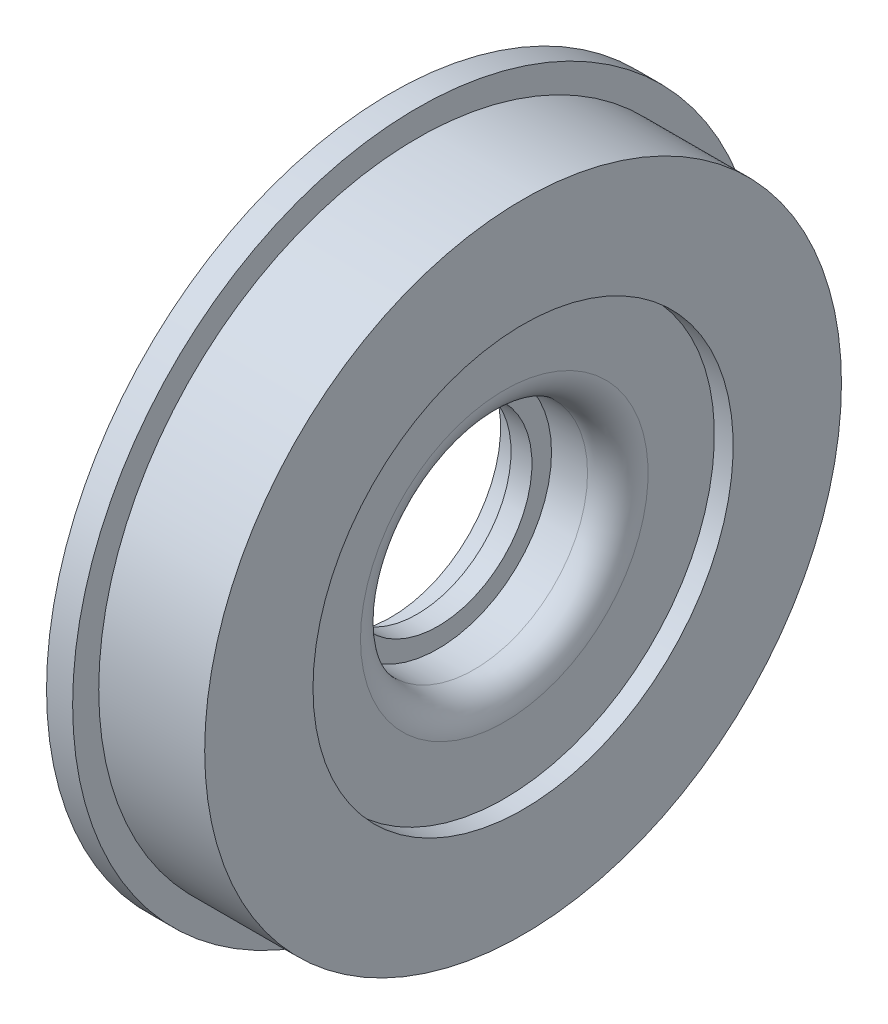
ISO-10303-21;
HEADER;
FILE_DESCRIPTION(('STEP AP214'),'2;1');
FILE_NAME('part.step','',(''),(''),'','','');
FILE_SCHEMA(('AUTOMOTIVE_DESIGN { 1 0 10303 214 1 1 1 1 }'));
ENDSEC;
DATA;
#1=APPLICATION_CONTEXT('core data for automotive mechanical design processes');
#2=APPLICATION_PROTOCOL_DEFINITION('international standard','automotive_design',2000,#1);
#3=PRODUCT_CONTEXT('',#1,'mechanical');
#4=PRODUCT('Part','Part','',(#3));
#5=PRODUCT_RELATED_PRODUCT_CATEGORY('part','',(#4));
#6=PRODUCT_DEFINITION_FORMATION('','',#4);
#7=PRODUCT_DEFINITION_CONTEXT('part definition',#1,'design');
#8=PRODUCT_DEFINITION('design','',#6,#7);
#9=PRODUCT_DEFINITION_SHAPE('','',#8);
#10=(LENGTH_UNIT() NAMED_UNIT(*) SI_UNIT(.MILLI.,.METRE.));
#11=(NAMED_UNIT(*) PLANE_ANGLE_UNIT() SI_UNIT($,.RADIAN.));
#12=(NAMED_UNIT(*) SI_UNIT($,.STERADIAN.) SOLID_ANGLE_UNIT());
#13=UNCERTAINTY_MEASURE_WITH_UNIT(LENGTH_MEASURE(1.E-05),#10,'distance_accuracy_value','');
#14=(GEOMETRIC_REPRESENTATION_CONTEXT(3) GLOBAL_UNCERTAINTY_ASSIGNED_CONTEXT((#13)) GLOBAL_UNIT_ASSIGNED_CONTEXT((#10,
#11,#12)) REPRESENTATION_CONTEXT('',''));
#15=CARTESIAN_POINT('',(0.,0.,0.));
#16=DIRECTION('',(0.,0.,1.));
#17=DIRECTION('',(1.,0.,0.));
#18=AXIS2_PLACEMENT_3D('',#15,#16,#17);
#19=CARTESIAN_POINT('',(0.,66.,0.));
#20=DIRECTION('',(1.,0.,0.));
#21=DIRECTION('',(0.,0.,-1.));
#22=AXIS2_PLACEMENT_3D('',#19,#20,#21);
#23=PLANE('',#22);
#24=CARTESIAN_POINT('',(0.,0.,0.));
#25=DIRECTION('',(-1.,0.,0.));
#26=DIRECTION('',(0.,0.,1.));
#27=AXIS2_PLACEMENT_3D('',#24,#25,#26);
#28=CIRCLE('',#27,21.);
#29=CARTESIAN_POINT('',(0.,0.,21.));
#30=VERTEX_POINT('',#29);
#31=EDGE_CURVE('E10',#30,#30,#28,.T.);
#32=ORIENTED_EDGE('',*,*,#31,.F.);
#33=EDGE_LOOP('',(#32));
#34=FACE_BOUND('',#33,.T.);
#35=CARTESIAN_POINT('',(0.,0.,0.));
#36=DIRECTION('',(-1.,0.,0.));
#37=DIRECTION('',(0.,0.,1.));
#38=AXIS2_PLACEMENT_3D('',#35,#36,#37);
#39=CIRCLE('',#38,66.);
#40=CARTESIAN_POINT('',(0.,0.,66.));
#41=VERTEX_POINT('',#40);
#42=EDGE_CURVE('E94',#41,#41,#39,.T.);
#43=ORIENTED_EDGE('',*,*,#42,.T.);
#44=EDGE_LOOP('',(#43));
#45=FACE_BOUND('',#44,.T.);
#46=ADVANCED_FACE('F37',(#34,#45),#23,.F.);
#47=CARTESIAN_POINT('',(0.,0.,0.));
#48=DIRECTION('',(-1.,0.,0.));
#49=DIRECTION('',(0.,0.,1.));
#50=AXIS2_PLACEMENT_3D('',#47,#48,#49);
#51=CYLINDRICAL_SURFACE('',#50,21.);
#52=CARTESIAN_POINT('',(5.,0.,0.));
#53=DIRECTION('',(-1.,0.,0.));
#54=DIRECTION('',(0.,0.,1.));
#55=AXIS2_PLACEMENT_3D('',#52,#53,#54);
#56=CIRCLE('',#55,21.);
#57=CARTESIAN_POINT('',(5.,0.,21.));
#58=VERTEX_POINT('',#57);
#59=EDGE_CURVE('E44',#58,#58,#56,.T.);
#60=ORIENTED_EDGE('',*,*,#59,.F.);
#61=EDGE_LOOP('',(#60));
#62=FACE_BOUND('',#61,.T.);
#63=ORIENTED_EDGE('',*,*,#31,.T.);
#64=EDGE_LOOP('',(#63));
#65=FACE_BOUND('',#64,.T.);
#66=ADVANCED_FACE('F163',(#62,#65),#51,.F.);
#67=CARTESIAN_POINT('',(5.,21.,0.));
#68=DIRECTION('',(1.,0.,0.));
#69=DIRECTION('',(0.,0.,-1.));
#70=AXIS2_PLACEMENT_3D('',#67,#68,#69);
#71=PLANE('',#70);
#72=CARTESIAN_POINT('',(5.,0.,0.));
#73=DIRECTION('',(-1.,0.,0.));
#74=DIRECTION('',(0.,0.,1.));
#75=AXIS2_PLACEMENT_3D('',#72,#73,#74);
#76=CIRCLE('',#75,18.);
#77=CARTESIAN_POINT('',(5.,0.,18.));
#78=VERTEX_POINT('',#77);
#79=EDGE_CURVE('E50',#78,#78,#76,.T.);
#80=ORIENTED_EDGE('',*,*,#79,.F.);
#81=EDGE_LOOP('',(#80));
#82=FACE_BOUND('',#81,.T.);
#83=ORIENTED_EDGE('',*,*,#59,.T.);
#84=EDGE_LOOP('',(#83));
#85=FACE_BOUND('',#84,.T.);
#86=ADVANCED_FACE('F158',(#82,#85),#71,.F.);
#87=CARTESIAN_POINT('',(0.,0.,0.));
#88=DIRECTION('',(-1.,0.,0.));
#89=DIRECTION('',(0.,0.,1.));
#90=AXIS2_PLACEMENT_3D('',#87,#88,#89);
#91=CYLINDRICAL_SURFACE('',#90,18.);
#92=CARTESIAN_POINT('',(8.99999999999999,0.,0.));
#93=DIRECTION('',(-1.,0.,0.));
#94=DIRECTION('',(0.,0.,1.));
#95=AXIS2_PLACEMENT_3D('',#92,#93,#94);
#96=CIRCLE('',#95,18.);
#97=CARTESIAN_POINT('',(8.99999999999999,0.,18.));
#98=VERTEX_POINT('',#97);
#99=EDGE_CURVE('E56',#98,#98,#96,.T.);
#100=ORIENTED_EDGE('',*,*,#99,.F.);
#101=EDGE_LOOP('',(#100));
#102=FACE_BOUND('',#101,.T.);
#103=ORIENTED_EDGE('',*,*,#79,.T.);
#104=EDGE_LOOP('',(#103));
#105=FACE_BOUND('',#104,.T.);
#106=ADVANCED_FACE('F152',(#102,#105),#91,.F.);
#107=CARTESIAN_POINT('',(8.99999999999999,18.,0.));
#108=DIRECTION('',(-1.,0.,0.));
#109=DIRECTION('',(0.,0.,1.));
#110=AXIS2_PLACEMENT_3D('',#107,#108,#109);
#111=PLANE('',#110);
#112=CARTESIAN_POINT('',(8.99999999999999,0.,0.));
#113=DIRECTION('',(-1.,0.,0.));
#114=DIRECTION('',(0.,0.,1.));
#115=AXIS2_PLACEMENT_3D('',#112,#113,#114);
#116=CIRCLE('',#115,21.75);
#117=CARTESIAN_POINT('',(8.99999999999999,0.,21.75));
#118=VERTEX_POINT('',#117);
#119=EDGE_CURVE('E62',#118,#118,#116,.T.);
#120=ORIENTED_EDGE('',*,*,#119,.F.);
#121=EDGE_LOOP('',(#120));
#122=FACE_BOUND('',#121,.T.);
#123=ORIENTED_EDGE('',*,*,#99,.T.);
#124=EDGE_LOOP('',(#123));
#125=FACE_BOUND('',#124,.T.);
#126=ADVANCED_FACE('F146',(#122,#125),#111,.F.);
#127=CARTESIAN_POINT('',(0.,0.,0.));
#128=DIRECTION('',(-1.,0.,0.));
#129=DIRECTION('',(0.,0.,1.));
#130=AXIS2_PLACEMENT_3D('',#127,#128,#129);
#131=CYLINDRICAL_SURFACE('',#130,21.75);
#132=CARTESIAN_POINT('',(15.9,0.,0.));
#133=DIRECTION('',(-1.,0.,0.));
#134=DIRECTION('',(0.,0.,1.));
#135=AXIS2_PLACEMENT_3D('',#132,#133,#134);
#136=CIRCLE('',#135,21.75);
#137=CARTESIAN_POINT('',(15.9,0.,21.75));
#138=VERTEX_POINT('',#137);
#139=EDGE_CURVE('E66',#138,#138,#136,.T.);
#140=ORIENTED_EDGE('',*,*,#139,.F.);
#141=EDGE_LOOP('',(#140));
#142=FACE_BOUND('',#141,.T.);
#143=ORIENTED_EDGE('',*,*,#119,.T.);
#144=EDGE_LOOP('',(#143));
#145=FACE_BOUND('',#144,.T.);
#146=ADVANCED_FACE('F140',(#142,#145),#131,.F.);
#147=CARTESIAN_POINT('',(15.9,0.,0.));
#148=DIRECTION('',(-1.,0.,0.));
#149=DIRECTION('',(0.,0.,1.));
#150=AXIS2_PLACEMENT_3D('',#147,#148,#149);
#151=TOROIDAL_SURFACE('',#150,27.55,5.8);
#152=CARTESIAN_POINT('',(21.7,0.,0.));
#153=DIRECTION('',(-1.,0.,0.));
#154=DIRECTION('',(0.,0.,1.));
#155=AXIS2_PLACEMENT_3D('',#152,#153,#154);
#156=CIRCLE('',#155,27.55);
#157=CARTESIAN_POINT('',(21.7,0.,27.55));
#158=VERTEX_POINT('',#157);
#159=EDGE_CURVE('E70',#158,#158,#156,.T.);
#160=ORIENTED_EDGE('',*,*,#159,.F.);
#161=EDGE_LOOP('',(#160));
#162=FACE_BOUND('',#161,.T.);
#163=ORIENTED_EDGE('',*,*,#139,.T.);
#164=EDGE_LOOP('',(#163));
#165=FACE_BOUND('',#164,.T.);
#166=ADVANCED_FACE('F134',(#162,#165),#151,.T.);
#167=CARTESIAN_POINT('',(21.7,27.55,0.));
#168=DIRECTION('',(-1.,0.,0.));
#169=DIRECTION('',(0.,0.,1.));
#170=AXIS2_PLACEMENT_3D('',#167,#168,#169);
#171=PLANE('',#170);
#172=CARTESIAN_POINT('',(21.7,0.,0.));
#173=DIRECTION('',(-1.,0.,0.));
#174=DIRECTION('',(0.,0.,1.));
#175=AXIS2_PLACEMENT_3D('',#172,#173,#174);
#176=CIRCLE('',#175,40.25);
#177=CARTESIAN_POINT('',(21.7,0.,40.25));
#178=VERTEX_POINT('',#177);
#179=EDGE_CURVE('E74',#178,#178,#176,.T.);
#180=ORIENTED_EDGE('',*,*,#179,.F.);
#181=EDGE_LOOP('',(#180));
#182=FACE_BOUND('',#181,.T.);
#183=ORIENTED_EDGE('',*,*,#159,.T.);
#184=EDGE_LOOP('',(#183));
#185=FACE_BOUND('',#184,.T.);
#186=ADVANCED_FACE('F128',(#182,#185),#171,.F.);
#187=CARTESIAN_POINT('',(0.,0.,0.));
#188=DIRECTION('',(-1.,0.,0.));
#189=DIRECTION('',(0.,0.,1.));
#190=AXIS2_PLACEMENT_3D('',#187,#188,#189);
#191=CYLINDRICAL_SURFACE('',#190,40.25);
#192=CARTESIAN_POINT('',(25.3,0.,0.));
#193=DIRECTION('',(-1.,0.,0.));
#194=DIRECTION('',(0.,0.,1.));
#195=AXIS2_PLACEMENT_3D('',#192,#193,#194);
#196=CIRCLE('',#195,40.25);
#197=CARTESIAN_POINT('',(25.3,0.,40.25));
#198=VERTEX_POINT('',#197);
#199=EDGE_CURVE('E78',#198,#198,#196,.T.);
#200=ORIENTED_EDGE('',*,*,#199,.F.);
#201=EDGE_LOOP('',(#200));
#202=FACE_BOUND('',#201,.T.);
#203=ORIENTED_EDGE('',*,*,#179,.T.);
#204=EDGE_LOOP('',(#203));
#205=FACE_BOUND('',#204,.T.);
#206=ADVANCED_FACE('F122',(#202,#205),#191,.F.);
#207=CARTESIAN_POINT('',(25.3,40.25,0.));
#208=DIRECTION('',(-1.,0.,0.));
#209=DIRECTION('',(0.,0.,1.));
#210=AXIS2_PLACEMENT_3D('',#207,#208,#209);
#211=PLANE('',#210);
#212=CARTESIAN_POINT('',(25.3,0.,0.));
#213=DIRECTION('',(-1.,0.,0.));
#214=DIRECTION('',(0.,0.,1.));
#215=AXIS2_PLACEMENT_3D('',#212,#213,#214);
#216=CIRCLE('',#215,61.);
#217=CARTESIAN_POINT('',(25.3,0.,61.));
#218=VERTEX_POINT('',#217);
#219=EDGE_CURVE('E82',#218,#218,#216,.T.);
#220=ORIENTED_EDGE('',*,*,#219,.F.);
#221=EDGE_LOOP('',(#220));
#222=FACE_BOUND('',#221,.T.);
#223=ORIENTED_EDGE('',*,*,#199,.T.);
#224=EDGE_LOOP('',(#223));
#225=FACE_BOUND('',#224,.T.);
#226=ADVANCED_FACE('F116',(#222,#225),#211,.F.);
#227=CARTESIAN_POINT('',(0.,0.,0.));
#228=DIRECTION('',(-1.,0.,0.));
#229=DIRECTION('',(0.,0.,1.));
#230=AXIS2_PLACEMENT_3D('',#227,#228,#229);
#231=CYLINDRICAL_SURFACE('',#230,61.);
#232=CARTESIAN_POINT('',(4.99999999999999,0.,0.));
#233=DIRECTION('',(-1.,0.,0.));
#234=DIRECTION('',(0.,0.,1.));
#235=AXIS2_PLACEMENT_3D('',#232,#233,#234);
#236=CIRCLE('',#235,61.);
#237=CARTESIAN_POINT('',(4.99999999999999,0.,61.));
#238=VERTEX_POINT('',#237);
#239=EDGE_CURVE('E86',#238,#238,#236,.T.);
#240=ORIENTED_EDGE('',*,*,#239,.F.);
#241=EDGE_LOOP('',(#240));
#242=FACE_BOUND('',#241,.T.);
#243=ORIENTED_EDGE('',*,*,#219,.T.);
#244=EDGE_LOOP('',(#243));
#245=FACE_BOUND('',#244,.T.);
#246=ADVANCED_FACE('F110',(#242,#245),#231,.T.);
#247=CARTESIAN_POINT('',(4.99999999999999,61.,0.));
#248=DIRECTION('',(-1.,0.,0.));
#249=DIRECTION('',(0.,0.,1.));
#250=AXIS2_PLACEMENT_3D('',#247,#248,#249);
#251=PLANE('',#250);
#252=CARTESIAN_POINT('',(4.99999999999999,0.,0.));
#253=DIRECTION('',(-1.,0.,0.));
#254=DIRECTION('',(0.,0.,1.));
#255=AXIS2_PLACEMENT_3D('',#252,#253,#254);
#256=CIRCLE('',#255,66.);
#257=CARTESIAN_POINT('',(4.99999999999999,0.,66.));
#258=VERTEX_POINT('',#257);
#259=EDGE_CURVE('E90',#258,#258,#256,.T.);
#260=ORIENTED_EDGE('',*,*,#259,.F.);
#261=EDGE_LOOP('',(#260));
#262=FACE_BOUND('',#261,.T.);
#263=ORIENTED_EDGE('',*,*,#239,.T.);
#264=EDGE_LOOP('',(#263));
#265=FACE_BOUND('',#264,.T.);
#266=ADVANCED_FACE('F104',(#262,#265),#251,.F.);
#267=CARTESIAN_POINT('',(0.,0.,0.));
#268=DIRECTION('',(-1.,0.,0.));
#269=DIRECTION('',(0.,0.,1.));
#270=AXIS2_PLACEMENT_3D('',#267,#268,#269);
#271=CYLINDRICAL_SURFACE('',#270,66.);
#272=ORIENTED_EDGE('',*,*,#42,.F.);
#273=EDGE_LOOP('',(#272));
#274=FACE_BOUND('',#273,.T.);
#275=ORIENTED_EDGE('',*,*,#259,.T.);
#276=EDGE_LOOP('',(#275));
#277=FACE_BOUND('',#276,.T.);
#278=ADVANCED_FACE('F101',(#274,#277),#271,.T.);
#279=CLOSED_SHELL('',(#46,#66,#86,#106,#126,#146,#166,#186,#206,#226,#246,#266,#278));
#280=MANIFOLD_SOLID_BREP('B2',#279);
#281=ADVANCED_BREP_SHAPE_REPRESENTATION('',(#18,#280),#14);
#282=SHAPE_DEFINITION_REPRESENTATION(#9,#281);
ENDSEC;
END-ISO-10303-21;
